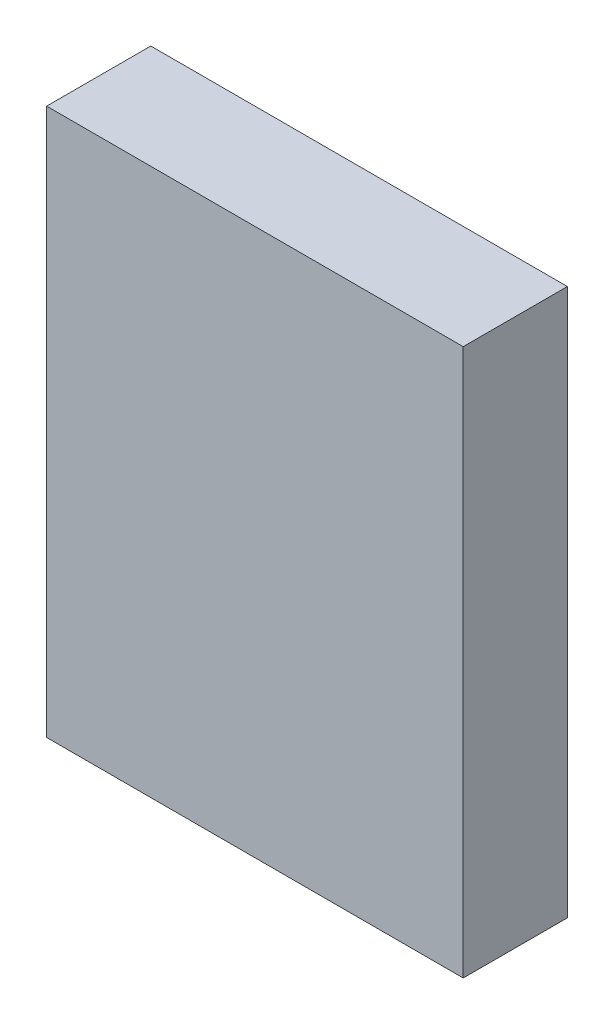
ISO-10303-21;
HEADER;
FILE_DESCRIPTION(('STEP AP214'),'2;1');
FILE_NAME('part.step','',(''),(''),'','','');
FILE_SCHEMA(('AUTOMOTIVE_DESIGN { 1 0 10303 214 1 1 1 1 }'));
ENDSEC;
DATA;
#1=APPLICATION_CONTEXT('core data for automotive mechanical design processes');
#2=APPLICATION_PROTOCOL_DEFINITION('international standard','automotive_design',2000,#1);
#3=PRODUCT_CONTEXT('',#1,'mechanical');
#4=PRODUCT('Part','Part','',(#3));
#5=PRODUCT_RELATED_PRODUCT_CATEGORY('part','',(#4));
#6=PRODUCT_DEFINITION_FORMATION('','',#4);
#7=PRODUCT_DEFINITION_CONTEXT('part definition',#1,'design');
#8=PRODUCT_DEFINITION('design','',#6,#7);
#9=PRODUCT_DEFINITION_SHAPE('','',#8);
#10=(LENGTH_UNIT() NAMED_UNIT(*) SI_UNIT(.MILLI.,.METRE.));
#11=(NAMED_UNIT(*) PLANE_ANGLE_UNIT() SI_UNIT($,.RADIAN.));
#12=(NAMED_UNIT(*) SI_UNIT($,.STERADIAN.) SOLID_ANGLE_UNIT());
#13=UNCERTAINTY_MEASURE_WITH_UNIT(LENGTH_MEASURE(1.E-05),#10,'distance_accuracy_value','');
#14=(GEOMETRIC_REPRESENTATION_CONTEXT(3) GLOBAL_UNCERTAINTY_ASSIGNED_CONTEXT((#13)) GLOBAL_UNIT_ASSIGNED_CONTEXT((#10,
#11,#12)) REPRESENTATION_CONTEXT('',''));
#15=CARTESIAN_POINT('',(0.,0.,0.));
#16=DIRECTION('',(0.,0.,1.));
#17=DIRECTION('',(1.,0.,0.));
#18=AXIS2_PLACEMENT_3D('',#15,#16,#17);
#19=CARTESIAN_POINT('',(1.425,-2.8255,0.));
#20=DIRECTION('',(1.,0.,0.));
#21=DIRECTION('',(0.,0.,1.));
#22=AXIS2_PLACEMENT_3D('',#19,#20,#21);
#23=PLANE('',#22);
#24=DIRECTION('',(0.,1.,0.));
#25=VECTOR('',#24,1.);
#26=CARTESIAN_POINT('',(1.425,-2.8255,0.1));
#27=LINE('',#26,#25);
#28=CARTESIAN_POINT('',(1.425,-2.8255,0.1));
#29=VERTEX_POINT('',#28);
#30=CARTESIAN_POINT('',(1.425,-2.3005,0.1));
#31=VERTEX_POINT('',#30);
#32=EDGE_CURVE('E11',#29,#31,#27,.T.);
#33=ORIENTED_EDGE('',*,*,#32,.T.);
#34=DIRECTION('',(0.,0.,1.));
#35=VECTOR('',#34,1.);
#36=CARTESIAN_POINT('',(1.425,-2.3005,0.));
#37=LINE('',#36,#35);
#38=CARTESIAN_POINT('',(1.425,-2.3005,0.));
#39=VERTEX_POINT('',#38);
#40=EDGE_CURVE('E24',#39,#31,#37,.T.);
#41=ORIENTED_EDGE('',*,*,#40,.F.);
#42=DIRECTION('',(0.,1.,0.));
#43=VECTOR('',#42,1.);
#44=CARTESIAN_POINT('',(1.425,-2.8255,0.));
#45=LINE('',#44,#43);
#46=CARTESIAN_POINT('',(1.425,-2.8255,0.));
#47=VERTEX_POINT('',#46);
#48=EDGE_CURVE('E86',#47,#39,#45,.T.);
#49=ORIENTED_EDGE('',*,*,#48,.F.);
#50=DIRECTION('',(0.,0.,1.));
#51=VECTOR('',#50,1.);
#52=CARTESIAN_POINT('',(1.425,-2.8255,0.));
#53=LINE('',#52,#51);
#54=EDGE_CURVE('E36',#47,#29,#53,.T.);
#55=ORIENTED_EDGE('',*,*,#54,.T.);
#56=EDGE_LOOP('',(#33,#41,#49,#55));
#57=FACE_BOUND('',#56,.T.);
#58=ADVANCED_FACE('F17',(#57),#23,.F.);
#59=CARTESIAN_POINT('',(1.825,-2.8255,0.));
#60=DIRECTION('',(1.,0.,0.));
#61=DIRECTION('',(0.,0.,1.));
#62=AXIS2_PLACEMENT_3D('',#59,#60,#61);
#63=PLANE('',#62);
#64=DIRECTION('',(0.,0.,1.));
#65=VECTOR('',#64,1.);
#66=CARTESIAN_POINT('',(1.825,-2.8255,0.));
#67=LINE('',#66,#65);
#68=CARTESIAN_POINT('',(1.825,-2.8255,0.));
#69=VERTEX_POINT('',#68);
#70=CARTESIAN_POINT('',(1.825,-2.8255,0.1));
#71=VERTEX_POINT('',#70);
#72=EDGE_CURVE('E83',#69,#71,#67,.T.);
#73=ORIENTED_EDGE('',*,*,#72,.F.);
#74=DIRECTION('',(0.,1.,0.));
#75=VECTOR('',#74,1.);
#76=CARTESIAN_POINT('',(1.825,-2.8255,0.));
#77=LINE('',#76,#75);
#78=CARTESIAN_POINT('',(1.825,-2.3005,0.));
#79=VERTEX_POINT('',#78);
#80=EDGE_CURVE('E63',#69,#79,#77,.T.);
#81=ORIENTED_EDGE('',*,*,#80,.T.);
#82=DIRECTION('',(0.,0.,1.));
#83=VECTOR('',#82,1.);
#84=CARTESIAN_POINT('',(1.825,-2.3005,0.));
#85=LINE('',#84,#83);
#86=CARTESIAN_POINT('',(1.825,-2.3005,0.1));
#87=VERTEX_POINT('',#86);
#88=EDGE_CURVE('E57',#79,#87,#85,.T.);
#89=ORIENTED_EDGE('',*,*,#88,.T.);
#90=DIRECTION('',(0.,1.,0.));
#91=VECTOR('',#90,1.);
#92=CARTESIAN_POINT('',(1.825,-2.8255,0.1));
#93=LINE('',#92,#91);
#94=EDGE_CURVE('E60',#71,#87,#93,.T.);
#95=ORIENTED_EDGE('',*,*,#94,.F.);
#96=EDGE_LOOP('',(#73,#81,#89,#95));
#97=FACE_BOUND('',#96,.T.);
#98=ADVANCED_FACE('F59',(#97),#63,.T.);
#99=CARTESIAN_POINT('',(1.425,-2.8255,0.));
#100=DIRECTION('',(0.,1.,0.));
#101=DIRECTION('',(0.,0.,1.));
#102=AXIS2_PLACEMENT_3D('',#99,#100,#101);
#103=PLANE('',#102);
#104=ORIENTED_EDGE('',*,*,#72,.T.);
#105=DIRECTION('',(1.,0.,0.));
#106=VECTOR('',#105,1.);
#107=CARTESIAN_POINT('',(1.425,-2.8255,0.1));
#108=LINE('',#107,#106);
#109=EDGE_CURVE('E71',#29,#71,#108,.T.);
#110=ORIENTED_EDGE('',*,*,#109,.F.);
#111=ORIENTED_EDGE('',*,*,#54,.F.);
#112=DIRECTION('',(1.,0.,0.));
#113=VECTOR('',#112,1.);
#114=CARTESIAN_POINT('',(1.425,-2.8255,0.));
#115=LINE('',#114,#113);
#116=EDGE_CURVE('E76',#47,#69,#115,.T.);
#117=ORIENTED_EDGE('',*,*,#116,.T.);
#118=EDGE_LOOP('',(#104,#110,#111,#117));
#119=FACE_BOUND('',#118,.T.);
#120=ADVANCED_FACE('F91',(#119),#103,.F.);
#121=CARTESIAN_POINT('',(1.425,-2.3005,0.));
#122=DIRECTION('',(0.,1.,0.));
#123=DIRECTION('',(0.,0.,1.));
#124=AXIS2_PLACEMENT_3D('',#121,#122,#123);
#125=PLANE('',#124);
#126=DIRECTION('',(1.,0.,0.));
#127=VECTOR('',#126,1.);
#128=CARTESIAN_POINT('',(1.425,-2.3005,0.));
#129=LINE('',#128,#127);
#130=EDGE_CURVE('E74',#39,#79,#129,.T.);
#131=ORIENTED_EDGE('',*,*,#130,.F.);
#132=ORIENTED_EDGE('',*,*,#40,.T.);
#133=DIRECTION('',(1.,0.,0.));
#134=VECTOR('',#133,1.);
#135=CARTESIAN_POINT('',(1.425,-2.3005,0.1));
#136=LINE('',#135,#134);
#137=EDGE_CURVE('E69',#31,#87,#136,.T.);
#138=ORIENTED_EDGE('',*,*,#137,.T.);
#139=ORIENTED_EDGE('',*,*,#88,.F.);
#140=EDGE_LOOP('',(#131,#132,#138,#139));
#141=FACE_BOUND('',#140,.T.);
#142=ADVANCED_FACE('F73',(#141),#125,.T.);
#143=CARTESIAN_POINT('',(1.425,-2.8255,0.));
#144=DIRECTION('',(0.,0.,1.));
#145=DIRECTION('',(1.,0.,0.));
#146=AXIS2_PLACEMENT_3D('',#143,#144,#145);
#147=PLANE('',#146);
#148=ORIENTED_EDGE('',*,*,#130,.T.);
#149=ORIENTED_EDGE('',*,*,#80,.F.);
#150=ORIENTED_EDGE('',*,*,#116,.F.);
#151=ORIENTED_EDGE('',*,*,#48,.T.);
#152=EDGE_LOOP('',(#148,#149,#150,#151));
#153=FACE_BOUND('',#152,.T.);
#154=ADVANCED_FACE('F89',(#153),#147,.F.);
#155=CARTESIAN_POINT('',(1.425,-2.8255,0.1));
#156=DIRECTION('',(0.,0.,1.));
#157=DIRECTION('',(1.,0.,0.));
#158=AXIS2_PLACEMENT_3D('',#155,#156,#157);
#159=PLANE('',#158);
#160=ORIENTED_EDGE('',*,*,#32,.F.);
#161=ORIENTED_EDGE('',*,*,#109,.T.);
#162=ORIENTED_EDGE('',*,*,#94,.T.);
#163=ORIENTED_EDGE('',*,*,#137,.F.);
#164=EDGE_LOOP('',(#160,#161,#162,#163));
#165=FACE_BOUND('',#164,.T.);
#166=ADVANCED_FACE('F68',(#165),#159,.T.);
#167=CLOSED_SHELL('',(#58,#98,#120,#142,#154,#166));
#168=MANIFOLD_SOLID_BREP('B1',#167);
#169=ADVANCED_BREP_SHAPE_REPRESENTATION('',(#18,#168),#14);
#170=SHAPE_DEFINITION_REPRESENTATION(#9,#169);
ENDSEC;
END-ISO-10303-21;
